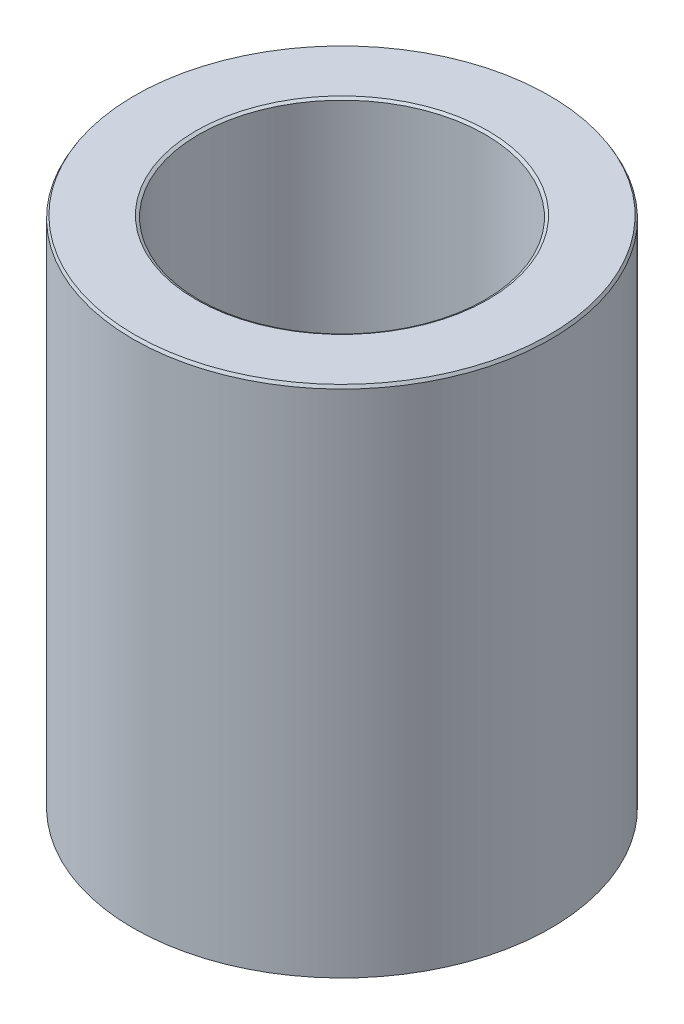
ISO-10303-21;
HEADER;
FILE_DESCRIPTION(('STEP AP214'),'2;1');
FILE_NAME('part.step','',(''),(''),'','','');
FILE_SCHEMA(('AUTOMOTIVE_DESIGN { 1 0 10303 214 1 1 1 1 }'));
ENDSEC;
DATA;
#1=APPLICATION_CONTEXT('core data for automotive mechanical design processes');
#2=APPLICATION_PROTOCOL_DEFINITION('international standard','automotive_design',2000,#1);
#3=PRODUCT_CONTEXT('',#1,'mechanical');
#4=PRODUCT('Part','Part','',(#3));
#5=PRODUCT_RELATED_PRODUCT_CATEGORY('part','',(#4));
#6=PRODUCT_DEFINITION_FORMATION('','',#4);
#7=PRODUCT_DEFINITION_CONTEXT('part definition',#1,'design');
#8=PRODUCT_DEFINITION('design','',#6,#7);
#9=PRODUCT_DEFINITION_SHAPE('','',#8);
#10=(LENGTH_UNIT() NAMED_UNIT(*) SI_UNIT(.MILLI.,.METRE.));
#11=(NAMED_UNIT(*) PLANE_ANGLE_UNIT() SI_UNIT($,.RADIAN.));
#12=(NAMED_UNIT(*) SI_UNIT($,.STERADIAN.) SOLID_ANGLE_UNIT());
#13=UNCERTAINTY_MEASURE_WITH_UNIT(LENGTH_MEASURE(1.E-05),#10,'distance_accuracy_value','');
#14=(GEOMETRIC_REPRESENTATION_CONTEXT(3) GLOBAL_UNCERTAINTY_ASSIGNED_CONTEXT((#13)) GLOBAL_UNIT_ASSIGNED_CONTEXT((#10,
#11,#12)) REPRESENTATION_CONTEXT('',''));
#15=CARTESIAN_POINT('',(0.,0.,0.));
#16=DIRECTION('',(0.,0.,1.));
#17=DIRECTION('',(1.,0.,0.));
#18=AXIS2_PLACEMENT_3D('',#15,#16,#17);
#19=CARTESIAN_POINT('',(0.,116.983579519683,0.));
#20=DIRECTION('',(0.,-1.,0.));
#21=DIRECTION('',(0.,0.,-1.));
#22=AXIS2_PLACEMENT_3D('',#19,#20,#21);
#23=CYLINDRICAL_SURFACE('',#22,47.5);
#24=CARTESIAN_POINT('',(0.,0.381515373261476,0.));
#25=DIRECTION('',(0.,1.,0.));
#26=DIRECTION('',(0.,0.,1.));
#27=AXIS2_PLACEMENT_3D('',#24,#25,#26);
#28=CIRCLE('',#27,47.5);
#29=CARTESIAN_POINT('',(0.,0.381515373261476,47.5));
#30=VERTEX_POINT('',#29);
#31=EDGE_CURVE('E10',#30,#30,#28,.T.);
#32=ORIENTED_EDGE('',*,*,#31,.T.);
#33=EDGE_LOOP('',(#32));
#34=FACE_BOUND('',#33,.T.);
#35=CARTESIAN_POINT('',(0.,116.322775509325,0.));
#36=DIRECTION('',(0.,1.,0.));
#37=DIRECTION('',(0.,0.,1.));
#38=AXIS2_PLACEMENT_3D('',#35,#36,#37);
#39=CIRCLE('',#38,47.5);
#40=CARTESIAN_POINT('',(0.,116.322775509325,47.5));
#41=VERTEX_POINT('',#40);
#42=EDGE_CURVE('E50',#41,#41,#39,.F.);
#43=ORIENTED_EDGE('',*,*,#42,.T.);
#44=EDGE_LOOP('',(#43));
#45=FACE_BOUND('',#44,.T.);
#46=ADVANCED_FACE('F39',(#34,#45),#23,.T.);
#47=CARTESIAN_POINT('',(0.,116.983579519683,0.));
#48=DIRECTION('',(0.,1.,0.));
#49=DIRECTION('',(0.,0.,1.));
#50=AXIS2_PLACEMENT_3D('',#47,#48,#49);
#51=PLANE('',#50);
#52=CARTESIAN_POINT('',(0.,116.983579519683,0.));
#53=DIRECTION('',(0.,1.,0.));
#54=DIRECTION('',(0.,0.,1.));
#55=AXIS2_PLACEMENT_3D('',#52,#53,#54);
#56=CIRCLE('',#55,33.2110311290898);
#57=CARTESIAN_POINT('',(0.,116.983579519683,33.2110311290898));
#58=VERTEX_POINT('',#57);
#59=EDGE_CURVE('E58',#58,#58,#56,.F.);
#60=ORIENTED_EDGE('',*,*,#59,.T.);
#61=EDGE_LOOP('',(#60));
#62=FACE_BOUND('',#61,.T.);
#63=CARTESIAN_POINT('',(0.,116.983579519683,0.));
#64=DIRECTION('',(0.,1.,0.));
#65=DIRECTION('',(0.,0.,1.));
#66=AXIS2_PLACEMENT_3D('',#63,#64,#65);
#67=CIRCLE('',#66,47.1184846267385);
#68=CARTESIAN_POINT('',(0.,116.983579519683,47.1184846267385));
#69=VERTEX_POINT('',#68);
#70=EDGE_CURVE('E61',#69,#69,#67,.T.);
#71=ORIENTED_EDGE('',*,*,#70,.T.);
#72=EDGE_LOOP('',(#71));
#73=FACE_BOUND('',#72,.T.);
#74=ADVANCED_FACE('F88',(#62,#73),#51,.T.);
#75=CARTESIAN_POINT('',(0.,0.,0.));
#76=DIRECTION('',(0.,1.,0.));
#77=DIRECTION('',(0.,0.,1.));
#78=AXIS2_PLACEMENT_3D('',#75,#76,#77);
#79=PLANE('',#78);
#80=CARTESIAN_POINT('',(0.,0.,0.));
#81=DIRECTION('',(0.,1.,0.));
#82=DIRECTION('',(0.,0.,1.));
#83=AXIS2_PLACEMENT_3D('',#80,#81,#82);
#84=CIRCLE('',#83,32.9317424919938);
#85=CARTESIAN_POINT('',(0.,0.,-32.9317424919938));
#86=VERTEX_POINT('',#85);
#87=EDGE_CURVE('E51',#86,#86,#84,.T.);
#88=ORIENTED_EDGE('',*,*,#87,.T.);
#89=EDGE_LOOP('',(#88));
#90=FACE_BOUND('',#89,.T.);
#91=CARTESIAN_POINT('',(0.,0.,0.));
#92=DIRECTION('',(0.,1.,0.));
#93=DIRECTION('',(0.,0.,1.));
#94=AXIS2_PLACEMENT_3D('',#91,#92,#93);
#95=CIRCLE('',#94,46.8391959896425);
#96=CARTESIAN_POINT('',(0.,0.,46.8391959896425));
#97=VERTEX_POINT('',#96);
#98=EDGE_CURVE('E54',#97,#97,#95,.F.);
#99=ORIENTED_EDGE('',*,*,#98,.T.);
#100=EDGE_LOOP('',(#99));
#101=FACE_BOUND('',#100,.T.);
#102=ADVANCED_FACE('F83',(#90,#101),#79,.F.);
#103=CARTESIAN_POINT('',(0.,116.983579519683,0.));
#104=DIRECTION('',(0.,-1.,0.));
#105=DIRECTION('',(0.,0.,-1.));
#106=AXIS2_PLACEMENT_3D('',#103,#104,#105);
#107=CYLINDRICAL_SURFACE('',#106,32.5502271187323);
#108=CARTESIAN_POINT('',(0.,116.602064146421,0.));
#109=DIRECTION('',(0.,1.,0.));
#110=DIRECTION('',(0.,0.,1.));
#111=AXIS2_PLACEMENT_3D('',#108,#109,#110);
#112=CIRCLE('',#111,32.5502271187323);
#113=CARTESIAN_POINT('',(0.,116.602064146421,32.5502271187323));
#114=VERTEX_POINT('',#113);
#115=EDGE_CURVE('E67',#114,#114,#112,.T.);
#116=ORIENTED_EDGE('',*,*,#115,.T.);
#117=EDGE_LOOP('',(#116));
#118=FACE_BOUND('',#117,.T.);
#119=CARTESIAN_POINT('',(0.,0.660804010357507,0.));
#120=DIRECTION('',(0.,1.,0.));
#121=DIRECTION('',(0.,0.,1.));
#122=AXIS2_PLACEMENT_3D('',#119,#120,#121);
#123=CIRCLE('',#122,32.5502271187323);
#124=CARTESIAN_POINT('',(0.,0.660804010357507,-32.5502271187323));
#125=VERTEX_POINT('',#124);
#126=EDGE_CURVE('E69',#125,#125,#123,.F.);
#127=ORIENTED_EDGE('',*,*,#126,.T.);
#128=EDGE_LOOP('',(#127));
#129=FACE_BOUND('',#128,.T.);
#130=ADVANCED_FACE('F71',(#118,#129),#107,.F.);
#131=CARTESIAN_POINT('',(0.,116.602064146421,0.));
#132=DIRECTION('',(0.,1.,0.));
#133=DIRECTION('',(0.,0.,1.));
#134=AXIS2_PLACEMENT_3D('',#131,#132,#133);
#135=CONICAL_SURFACE('',#134,32.5502271187323,1.04719755119659);
#136=ORIENTED_EDGE('',*,*,#59,.F.);
#137=EDGE_LOOP('',(#136));
#138=FACE_BOUND('',#137,.T.);
#139=ORIENTED_EDGE('',*,*,#115,.F.);
#140=EDGE_LOOP('',(#139));
#141=FACE_BOUND('',#140,.T.);
#142=ADVANCED_FACE('F77',(#138,#141),#135,.F.);
#143=CARTESIAN_POINT('',(0.,0.,0.));
#144=DIRECTION('',(0.,-1.,0.));
#145=DIRECTION('',(0.,0.,-1.));
#146=AXIS2_PLACEMENT_3D('',#143,#144,#145);
#147=CONICAL_SURFACE('',#146,32.9317424919938,0.523598775598298);
#148=CARTESIAN_POINT('',(0.,0.660804010357507,-32.5502271187323));
#149=CARTESIAN_POINT('',(0.,0.653920635249618,-32.5542012372038));
#150=CARTESIAN_POINT('',(0.,0.647037260141727,-32.5581753556753));
#151=CARTESIAN_POINT('',(0.,0.633270509925944,-32.5661235926182));
#152=CARTESIAN_POINT('',(0.,0.626387134818053,-32.5700977110897));
#153=CARTESIAN_POINT('',(0.,0.612620384602272,-32.5780459480326));
#154=CARTESIAN_POINT('',(0.,0.605737009494382,-32.5820200665041));
#155=CARTESIAN_POINT('',(0.,0.591970259278601,-32.5899683034471));
#156=CARTESIAN_POINT('',(0.,0.585086884170709,-32.5939424219185));
#157=CARTESIAN_POINT('',(0.,0.571320133954928,-32.6018906588615));
#158=CARTESIAN_POINT('',(0.,0.564436758847038,-32.605864777333));
#159=CARTESIAN_POINT('',(0.,0.550670008631257,-32.6138130142759));
#160=CARTESIAN_POINT('',(0.,0.543786633523365,-32.6177871327474));
#161=CARTESIAN_POINT('',(0.,0.530019883307584,-32.6257353696903));
#162=CARTESIAN_POINT('',(0.,0.523136508199694,-32.6297094881618));
#163=CARTESIAN_POINT('',(0.,0.509369757983912,-32.6376577251047));
#164=CARTESIAN_POINT('',(0.,0.502486382876021,-32.6416318435762));
#165=CARTESIAN_POINT('',(0.,0.488719632660239,-32.6495800805192));
#166=CARTESIAN_POINT('',(0.,0.481836257552349,-32.6535541989906));
#167=CARTESIAN_POINT('',(0.,0.468069507336568,-32.6615024359336));
#168=CARTESIAN_POINT('',(0.,0.461186132228678,-32.6654765544051));
#169=CARTESIAN_POINT('',(0.,0.447419382012896,-32.673424791348));
#170=CARTESIAN_POINT('',(0.,0.440536006905004,-32.6773989098195));
#171=CARTESIAN_POINT('',(0.,0.426769256689223,-32.6853471467624));
#172=CARTESIAN_POINT('',(0.,0.419885881581333,-32.6893212652339));
#173=CARTESIAN_POINT('',(0.,0.406119131365552,-32.6972695021769));
#174=CARTESIAN_POINT('',(0.,0.39923575625766,-32.7012436206483));
#175=CARTESIAN_POINT('',(0.,0.385469006041879,-32.7091918575913));
#176=CARTESIAN_POINT('',(0.,0.378585630933989,-32.7131659760628));
#177=CARTESIAN_POINT('',(0.,0.364818880718208,-32.7211142130057));
#178=CARTESIAN_POINT('',(0.,0.357935505610316,-32.7250883314772));
#179=CARTESIAN_POINT('',(0.,0.344168755394534,-32.7330365684201));
#180=CARTESIAN_POINT('',(0.,0.337285380286644,-32.7370106868916));
#181=CARTESIAN_POINT('',(0.,0.323518630070863,-32.7449589238345));
#182=CARTESIAN_POINT('',(0.,0.316635254962973,-32.748933042306));
#183=CARTESIAN_POINT('',(0.,0.302868504747191,-32.756881279249));
#184=CARTESIAN_POINT('',(0.,0.2959851296393,-32.7608553977204));
#185=CARTESIAN_POINT('',(0.,0.282218379423518,-32.7688036346634));
#186=CARTESIAN_POINT('',(0.,0.275335004315629,-32.7727777531349));
#187=CARTESIAN_POINT('',(0.,0.261568254099847,-32.7807259900778));
#188=CARTESIAN_POINT('',(0.,0.254684878991955,-32.7847001085493));
#189=CARTESIAN_POINT('',(0.,0.240918128776174,-32.7926483454922));
#190=CARTESIAN_POINT('',(0.,0.234034753668284,-32.7966224639637));
#191=CARTESIAN_POINT('',(0.,0.220268003452503,-32.8045707009067));
#192=CARTESIAN_POINT('',(0.,0.213384628344611,-32.8085448193781));
#193=CARTESIAN_POINT('',(0.,0.19961787812883,-32.8164930563211));
#194=CARTESIAN_POINT('',(0.,0.19273450302094,-32.8204671747925));
#195=CARTESIAN_POINT('',(0.,0.178967752805159,-32.8284154117355));
#196=CARTESIAN_POINT('',(0.,0.172084377697267,-32.832389530207));
#197=CARTESIAN_POINT('',(0.,0.158317627481485,-32.8403377671499));
#198=CARTESIAN_POINT('',(0.,0.151434252373595,-32.8443118856214));
#199=CARTESIAN_POINT('',(0.,0.137667502157814,-32.8522601225643));
#200=CARTESIAN_POINT('',(0.,0.130784127049924,-32.8562342410358));
#201=CARTESIAN_POINT('',(0.,0.117017376834142,-32.8641824779788));
#202=CARTESIAN_POINT('',(0.,0.110134001726251,-32.8681565964502));
#203=CARTESIAN_POINT('',(0.,0.0963672515104694,-32.8761048333932));
#204=CARTESIAN_POINT('',(0.,0.0894838764025796,-32.8800789518647));
#205=CARTESIAN_POINT('',(0.,0.0757171261867982,-32.8880271888076));
#206=CARTESIAN_POINT('',(0.,0.0688337510789065,-32.8920013072791));
#207=CARTESIAN_POINT('',(0.,0.0550670008631251,-32.899949544222));
#208=CARTESIAN_POINT('',(0.,0.0481836257552353,-32.9039236626935));
#209=CARTESIAN_POINT('',(0.,0.0344168755394542,-32.9118718996364));
#210=CARTESIAN_POINT('',(0.,0.0275335004315629,-32.9158460181079));
#211=CARTESIAN_POINT('',(0.,0.0137667502157803,-32.9237942550509));
#212=CARTESIAN_POINT('',(0.,0.00688337510788904,-32.9277683735223));
#213=CARTESIAN_POINT('',(0.,0.,-32.9317424919938));
#214=B_SPLINE_CURVE_WITH_KNOTS('',3,(#148,#149,#150,#151,#152,#153,#154,#155,#156,#157,#158,
#159,#160,#161,#162,#163,#164,#165,#166,#167,#168,#169,#170,#171,#172,#173,#174,#175,#176,#177,
#178,#179,#180,#181,#182,#183,#184,#185,#186,#187,#188,#189,#190,#191,#192,#193,#194,#195,#196,
#197,#198,#199,#200,#201,#202,#203,#204,#205,#206,#207,#208,#209,#210,#211,#212,#213),
.UNSPECIFIED.,.F.,.F.,(4,2,2,2,2,2,2,2,2,2,2,2,2,2,2,2,2,2,2,2,2,2,2,2,2,2,2,2,2,2,2,2,4),(0.,
0.0238447108288447,0.0476894216576859,0.0715341324865306,0.0953788433153719,0.119223554144217,
0.143068264973058,0.166912975801902,0.190757686630744,0.214602397459588,0.238447108288433,
0.262291819117274,0.286136529946119,0.30998124077496,0.333825951603805,0.357670662432646,
0.381515373261491,0.405360084090336,0.429204794919177,0.453049505748021,0.476894216576863,
0.500738927405707,0.524583638234549,0.548428349063393,0.572273059892234,0.596117770721079,
0.619962481549924,0.643807192378765,0.667651903207609,0.691496614036451,0.715341324865295,
0.739186035694137,0.763030746522981),.UNSPECIFIED.);
#215=EDGE_CURVE('BSEAM73',#125,#86,#214,.T.);
#216=ORIENTED_EDGE('',*,*,#126,.F.);
#217=ORIENTED_EDGE('',*,*,#87,.F.);
#218=ORIENTED_EDGE('',*,*,#215,.T.);
#219=ORIENTED_EDGE('',*,*,#215,.F.);
#220=EDGE_LOOP('',(#216,#218,#217,#219));
#221=FACE_BOUND('',#220,.T.);
#222=ADVANCED_FACE('F73',(#221),#147,.F.);
#223=CARTESIAN_POINT('',(0.,0.381515373261476,0.));
#224=DIRECTION('',(0.,1.,0.));
#225=DIRECTION('',(0.,0.,1.));
#226=AXIS2_PLACEMENT_3D('',#223,#224,#225);
#227=CONICAL_SURFACE('',#226,47.5,1.04719755119659);
#228=ORIENTED_EDGE('',*,*,#98,.F.);
#229=EDGE_LOOP('',(#228));
#230=FACE_BOUND('',#229,.T.);
#231=ORIENTED_EDGE('',*,*,#31,.F.);
#232=EDGE_LOOP('',(#231));
#233=FACE_BOUND('',#232,.T.);
#234=ADVANCED_FACE('F76',(#230,#233),#227,.T.);
#235=CARTESIAN_POINT('',(0.,116.983579519683,0.));
#236=DIRECTION('',(0.,-1.,0.));
#237=DIRECTION('',(0.,0.,-1.));
#238=AXIS2_PLACEMENT_3D('',#235,#236,#237);
#239=CONICAL_SURFACE('',#238,47.1184846267385,0.523598775598312);
#240=ORIENTED_EDGE('',*,*,#42,.F.);
#241=EDGE_LOOP('',(#240));
#242=FACE_BOUND('',#241,.T.);
#243=ORIENTED_EDGE('',*,*,#70,.F.);
#244=EDGE_LOOP('',(#243));
#245=FACE_BOUND('',#244,.T.);
#246=ADVANCED_FACE('F45',(#242,#245),#239,.T.);
#247=CLOSED_SHELL('',(#46,#74,#102,#130,#142,#222,#234,#246));
#248=MANIFOLD_SOLID_BREP('B2',#247);
#249=ADVANCED_BREP_SHAPE_REPRESENTATION('',(#18,#248),#14);
#250=SHAPE_DEFINITION_REPRESENTATION(#9,#249);
ENDSEC;
END-ISO-10303-21;
